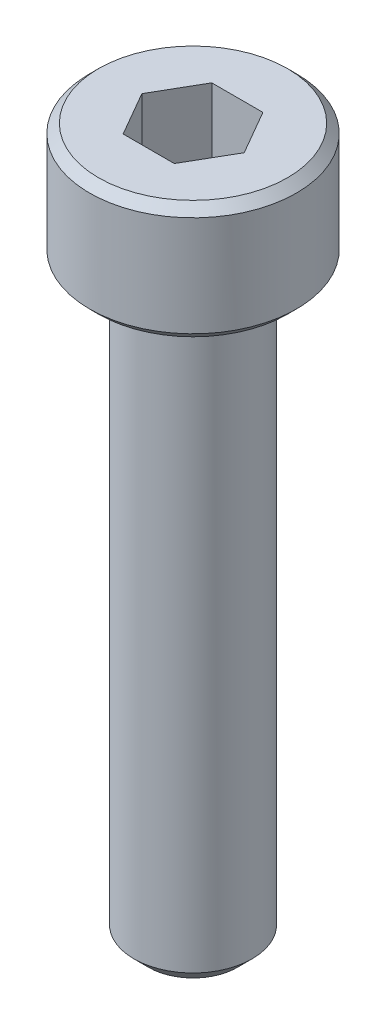
ISO-10303-21;
HEADER;
FILE_DESCRIPTION(('STEP AP214'),'2;1');
FILE_NAME('part.step','',(''),(''),'','','');
FILE_SCHEMA(('AUTOMOTIVE_DESIGN { 1 0 10303 214 1 1 1 1 }'));
ENDSEC;
DATA;
#1=APPLICATION_CONTEXT('core data for automotive mechanical design processes');
#2=APPLICATION_PROTOCOL_DEFINITION('international standard','automotive_design',2000,#1);
#3=PRODUCT_CONTEXT('',#1,'mechanical');
#4=PRODUCT('Part','Part','',(#3));
#5=PRODUCT_RELATED_PRODUCT_CATEGORY('part','',(#4));
#6=PRODUCT_DEFINITION_FORMATION('','',#4);
#7=PRODUCT_DEFINITION_CONTEXT('part definition',#1,'design');
#8=PRODUCT_DEFINITION('design','',#6,#7);
#9=PRODUCT_DEFINITION_SHAPE('','',#8);
#10=(LENGTH_UNIT() NAMED_UNIT(*) SI_UNIT(.MILLI.,.METRE.));
#11=(NAMED_UNIT(*) PLANE_ANGLE_UNIT() SI_UNIT($,.RADIAN.));
#12=(NAMED_UNIT(*) SI_UNIT($,.STERADIAN.) SOLID_ANGLE_UNIT());
#13=UNCERTAINTY_MEASURE_WITH_UNIT(LENGTH_MEASURE(1.E-05),#10,'distance_accuracy_value','');
#14=(GEOMETRIC_REPRESENTATION_CONTEXT(3) GLOBAL_UNCERTAINTY_ASSIGNED_CONTEXT((#13)) GLOBAL_UNIT_ASSIGNED_CONTEXT((#10,
#11,#12)) REPRESENTATION_CONTEXT('',''));
#15=CARTESIAN_POINT('',(0.,0.,0.));
#16=DIRECTION('',(0.,0.,1.));
#17=DIRECTION('',(1.,0.,0.));
#18=AXIS2_PLACEMENT_3D('',#15,#16,#17);
#19=CARTESIAN_POINT('',(0.866025403784439,21.,1.5));
#20=DIRECTION('',(0.866025403784439,0.,0.5));
#21=DIRECTION('',(0.5,0.,-0.866025403784439));
#22=AXIS2_PLACEMENT_3D('',#19,#20,#21);
#23=PLANE('',#22);
#24=DIRECTION('',(0.5,0.,-0.866025403784439));
#25=VECTOR('',#24,1.);
#26=CARTESIAN_POINT('',(0.866025403784439,21.,1.5));
#27=LINE('',#26,#25);
#28=CARTESIAN_POINT('',(0.866025403784439,21.,1.5));
#29=VERTEX_POINT('',#28);
#30=CARTESIAN_POINT('',(1.73205080756888,21.,0.));
#31=VERTEX_POINT('',#30);
#32=EDGE_CURVE('E66',#29,#31,#27,.T.);
#33=ORIENTED_EDGE('',*,*,#32,.F.);
#34=DIRECTION('',(0.,1.,0.));
#35=VECTOR('',#34,1.);
#36=CARTESIAN_POINT('',(0.866025403784439,21.,1.5));
#37=LINE('',#36,#35);
#38=CARTESIAN_POINT('',(0.866025403784439,24.,1.5));
#39=VERTEX_POINT('',#38);
#40=EDGE_CURVE('E85',#29,#39,#37,.T.);
#41=ORIENTED_EDGE('',*,*,#40,.T.);
#42=DIRECTION('',(0.5,0.,-0.866025403784439));
#43=VECTOR('',#42,1.);
#44=CARTESIAN_POINT('',(0.866025403784439,24.,1.5));
#45=LINE('',#44,#43);
#46=CARTESIAN_POINT('',(1.73205080756888,24.,0.));
#47=VERTEX_POINT('',#46);
#48=EDGE_CURVE('E73',#47,#39,#45,.F.);
#49=ORIENTED_EDGE('',*,*,#48,.F.);
#50=DIRECTION('',(0.,1.,0.));
#51=VECTOR('',#50,1.);
#52=CARTESIAN_POINT('',(1.73205080756888,21.,0.));
#53=LINE('',#52,#51);
#54=EDGE_CURVE('E80',#47,#31,#53,.F.);
#55=ORIENTED_EDGE('',*,*,#54,.T.);
#56=EDGE_LOOP('',(#33,#41,#49,#55));
#57=FACE_BOUND('',#56,.T.);
#58=ADVANCED_FACE('F17',(#57),#23,.F.);
#59=CARTESIAN_POINT('',(1.73205080756888,21.,0.));
#60=DIRECTION('',(0.866025403784438,0.,-0.5));
#61=DIRECTION('',(-0.5,0.,-0.866025403784438));
#62=AXIS2_PLACEMENT_3D('',#59,#60,#61);
#63=PLANE('',#62);
#64=DIRECTION('',(-0.5,0.,-0.866025403784438));
#65=VECTOR('',#64,1.);
#66=CARTESIAN_POINT('',(1.73205080756888,21.,0.));
#67=LINE('',#66,#65);
#68=CARTESIAN_POINT('',(0.866025403784438,21.,-1.5));
#69=VERTEX_POINT('',#68);
#70=EDGE_CURVE('E89',#31,#69,#67,.T.);
#71=ORIENTED_EDGE('',*,*,#70,.F.);
#72=ORIENTED_EDGE('',*,*,#54,.F.);
#73=DIRECTION('',(-0.5,0.,-0.866025403784438));
#74=VECTOR('',#73,1.);
#75=CARTESIAN_POINT('',(1.73205080756888,24.,0.));
#76=LINE('',#75,#74);
#77=CARTESIAN_POINT('',(0.866025403784439,24.,-1.5));
#78=VERTEX_POINT('',#77);
#79=EDGE_CURVE('E70',#78,#47,#76,.F.);
#80=ORIENTED_EDGE('',*,*,#79,.F.);
#81=DIRECTION('',(0.,1.,0.));
#82=VECTOR('',#81,1.);
#83=CARTESIAN_POINT('',(0.866025403784438,21.,-1.5));
#84=LINE('',#83,#82);
#85=EDGE_CURVE('E133',#78,#69,#84,.F.);
#86=ORIENTED_EDGE('',*,*,#85,.T.);
#87=EDGE_LOOP('',(#71,#72,#80,#86));
#88=FACE_BOUND('',#87,.T.);
#89=ADVANCED_FACE('F88',(#88),#63,.F.);
#90=CARTESIAN_POINT('',(-0.866025403784438,21.,1.5));
#91=DIRECTION('',(0.,0.,1.));
#92=DIRECTION('',(1.,0.,0.));
#93=AXIS2_PLACEMENT_3D('',#90,#91,#92);
#94=PLANE('',#93);
#95=DIRECTION('',(1.,0.,0.));
#96=VECTOR('',#95,1.);
#97=CARTESIAN_POINT('',(1.73205080756888,21.,1.5));
#98=LINE('',#97,#96);
#99=CARTESIAN_POINT('',(-0.866025403784438,21.,1.5));
#100=VERTEX_POINT('',#99);
#101=EDGE_CURVE('E131',#100,#29,#98,.T.);
#102=ORIENTED_EDGE('',*,*,#101,.F.);
#103=DIRECTION('',(0.,1.,0.));
#104=VECTOR('',#103,1.);
#105=CARTESIAN_POINT('',(-0.866025403784438,21.,1.5));
#106=LINE('',#105,#104);
#107=CARTESIAN_POINT('',(-0.866025403784438,24.,1.5));
#108=VERTEX_POINT('',#107);
#109=EDGE_CURVE('E121',#100,#108,#106,.T.);
#110=ORIENTED_EDGE('',*,*,#109,.T.);
#111=DIRECTION('',(1.,0.,0.));
#112=VECTOR('',#111,1.);
#113=CARTESIAN_POINT('',(-0.866025403784438,24.,1.5));
#114=LINE('',#113,#112);
#115=EDGE_CURVE('E91',#39,#108,#114,.F.);
#116=ORIENTED_EDGE('',*,*,#115,.F.);
#117=ORIENTED_EDGE('',*,*,#40,.F.);
#118=EDGE_LOOP('',(#102,#110,#116,#117));
#119=FACE_BOUND('',#118,.T.);
#120=ADVANCED_FACE('F138',(#119),#94,.F.);
#121=CARTESIAN_POINT('',(0.866025403784438,21.,-1.5));
#122=DIRECTION('',(0.,0.,-1.));
#123=DIRECTION('',(-1.,0.,0.));
#124=AXIS2_PLACEMENT_3D('',#121,#122,#123);
#125=PLANE('',#124);
#126=DIRECTION('',(1.,0.,0.));
#127=VECTOR('',#126,1.);
#128=CARTESIAN_POINT('',(1.73205080756888,21.,-1.5));
#129=LINE('',#128,#127);
#130=CARTESIAN_POINT('',(-0.866025403784438,21.,-1.5));
#131=VERTEX_POINT('',#130);
#132=EDGE_CURVE('E128',#69,#131,#129,.F.);
#133=ORIENTED_EDGE('',*,*,#132,.F.);
#134=ORIENTED_EDGE('',*,*,#85,.F.);
#135=DIRECTION('',(-1.,0.,0.));
#136=VECTOR('',#135,1.);
#137=CARTESIAN_POINT('',(0.866025403784438,24.,-1.5));
#138=LINE('',#137,#136);
#139=CARTESIAN_POINT('',(-0.866025403784438,24.,-1.5));
#140=VERTEX_POINT('',#139);
#141=EDGE_CURVE('E75',#140,#78,#138,.F.);
#142=ORIENTED_EDGE('',*,*,#141,.F.);
#143=DIRECTION('',(0.,1.,0.));
#144=VECTOR('',#143,1.);
#145=CARTESIAN_POINT('',(-0.866025403784438,21.,-1.5));
#146=LINE('',#145,#144);
#147=EDGE_CURVE('E119',#140,#131,#146,.F.);
#148=ORIENTED_EDGE('',*,*,#147,.T.);
#149=EDGE_LOOP('',(#133,#134,#142,#148));
#150=FACE_BOUND('',#149,.T.);
#151=ADVANCED_FACE('F150',(#150),#125,.F.);
#152=CARTESIAN_POINT('',(1.73205080756888,21.,0.));
#153=DIRECTION('',(0.,1.,0.));
#154=DIRECTION('',(0.,0.,1.));
#155=AXIS2_PLACEMENT_3D('',#152,#153,#154);
#156=PLANE('',#155);
#157=ORIENTED_EDGE('',*,*,#132,.T.);
#158=DIRECTION('',(-0.5,0.,0.866025403784439));
#159=VECTOR('',#158,1.);
#160=CARTESIAN_POINT('',(-0.866025403784438,21.,-1.5));
#161=LINE('',#160,#159);
#162=CARTESIAN_POINT('',(-1.73205080756888,21.,0.));
#163=VERTEX_POINT('',#162);
#164=EDGE_CURVE('E117',#131,#163,#161,.T.);
#165=ORIENTED_EDGE('',*,*,#164,.T.);
#166=DIRECTION('',(0.5,0.,0.866025403784439));
#167=VECTOR('',#166,1.);
#168=CARTESIAN_POINT('',(-1.73205080756888,21.,0.));
#169=LINE('',#168,#167);
#170=EDGE_CURVE('E124',#163,#100,#169,.T.);
#171=ORIENTED_EDGE('',*,*,#170,.T.);
#172=ORIENTED_EDGE('',*,*,#101,.T.);
#173=ORIENTED_EDGE('',*,*,#32,.T.);
#174=ORIENTED_EDGE('',*,*,#70,.T.);
#175=EDGE_LOOP('',(#157,#165,#171,#172,#173,#174));
#176=FACE_BOUND('',#175,.T.);
#177=ADVANCED_FACE('F151',(#176),#156,.T.);
#178=CARTESIAN_POINT('',(-1.73205080756888,21.,0.));
#179=DIRECTION('',(-0.866025403784439,0.,0.5));
#180=DIRECTION('',(0.5,0.,0.866025403784439));
#181=AXIS2_PLACEMENT_3D('',#178,#179,#180);
#182=PLANE('',#181);
#183=ORIENTED_EDGE('',*,*,#170,.F.);
#184=DIRECTION('',(0.,1.,0.));
#185=VECTOR('',#184,1.);
#186=CARTESIAN_POINT('',(-1.73205080756888,21.,0.));
#187=LINE('',#186,#185);
#188=CARTESIAN_POINT('',(-1.73205080756888,24.,0.));
#189=VERTEX_POINT('',#188);
#190=EDGE_CURVE('E115',#163,#189,#187,.T.);
#191=ORIENTED_EDGE('',*,*,#190,.T.);
#192=DIRECTION('',(0.5,0.,0.866025403784439));
#193=VECTOR('',#192,1.);
#194=CARTESIAN_POINT('',(-1.73205080756888,24.,0.));
#195=LINE('',#194,#193);
#196=EDGE_CURVE('E35',#108,#189,#195,.F.);
#197=ORIENTED_EDGE('',*,*,#196,.F.);
#198=ORIENTED_EDGE('',*,*,#109,.F.);
#199=EDGE_LOOP('',(#183,#191,#197,#198));
#200=FACE_BOUND('',#199,.T.);
#201=ADVANCED_FACE('F141',(#200),#182,.F.);
#202=CARTESIAN_POINT('',(-0.866025403784438,21.,-1.5));
#203=DIRECTION('',(-0.866025403784439,0.,-0.5));
#204=DIRECTION('',(-0.5,0.,0.866025403784439));
#205=AXIS2_PLACEMENT_3D('',#202,#203,#204);
#206=PLANE('',#205);
#207=ORIENTED_EDGE('',*,*,#164,.F.);
#208=ORIENTED_EDGE('',*,*,#147,.F.);
#209=DIRECTION('',(0.5,0.,-0.866025403784439));
#210=VECTOR('',#209,1.);
#211=CARTESIAN_POINT('',(-1.73205080756888,24.,0.));
#212=LINE('',#211,#210);
#213=EDGE_CURVE('E113',#189,#140,#212,.T.);
#214=ORIENTED_EDGE('',*,*,#213,.F.);
#215=ORIENTED_EDGE('',*,*,#190,.F.);
#216=EDGE_LOOP('',(#207,#208,#214,#215));
#217=FACE_BOUND('',#216,.T.);
#218=ADVANCED_FACE('F147',(#217),#206,.F.);
#219=CARTESIAN_POINT('',(0.,24.,-3.5));
#220=DIRECTION('',(0.,1.,0.));
#221=DIRECTION('',(0.,0.,1.));
#222=AXIS2_PLACEMENT_3D('',#219,#220,#221);
#223=PLANE('',#222);
#224=CARTESIAN_POINT('',(0.,24.0000000000009,0.));
#225=DIRECTION('',(0.,-1.,0.));
#226=DIRECTION('',(1.,0.,0.));
#227=AXIS2_PLACEMENT_3D('',#224,#225,#226);
#228=CIRCLE('',#227,3.19999999999254);
#229=CARTESIAN_POINT('',(3.19999999999254,24.0000000000009,0.));
#230=VERTEX_POINT('',#229);
#231=EDGE_CURVE('E20',#230,#230,#228,.T.);
#232=ORIENTED_EDGE('',*,*,#231,.F.);
#233=EDGE_LOOP('',(#232));
#234=FACE_BOUND('',#233,.T.);
#235=ORIENTED_EDGE('',*,*,#196,.T.);
#236=ORIENTED_EDGE('',*,*,#213,.T.);
#237=ORIENTED_EDGE('',*,*,#141,.T.);
#238=ORIENTED_EDGE('',*,*,#79,.T.);
#239=ORIENTED_EDGE('',*,*,#48,.T.);
#240=ORIENTED_EDGE('',*,*,#115,.T.);
#241=EDGE_LOOP('',(#235,#236,#237,#238,#239,#240));
#242=FACE_BOUND('',#241,.T.);
#243=ADVANCED_FACE('F72',(#234,#242),#223,.T.);
#244=CARTESIAN_POINT('',(0.,23.6999999999057,0.));
#245=DIRECTION('',(0.,-1.,0.));
#246=DIRECTION('',(1.,0.,0.));
#247=AXIS2_PLACEMENT_3D('',#244,#245,#246);
#248=CONICAL_SURFACE('',#247,3.49999999997408,0.78539816320797);
#249=CARTESIAN_POINT('',(0.,23.7,0.));
#250=DIRECTION('',(0.,-1.,0.));
#251=DIRECTION('',(0.,0.,-1.));
#252=AXIS2_PLACEMENT_3D('',#249,#250,#251);
#253=CIRCLE('',#252,3.5);
#254=CARTESIAN_POINT('',(0.,23.7,-3.5));
#255=VERTEX_POINT('',#254);
#256=EDGE_CURVE('E106',#255,#255,#253,.T.);
#257=ORIENTED_EDGE('',*,*,#256,.F.);
#258=EDGE_LOOP('',(#257));
#259=FACE_BOUND('',#258,.T.);
#260=ORIENTED_EDGE('',*,*,#231,.T.);
#261=EDGE_LOOP('',(#260));
#262=FACE_BOUND('',#261,.T.);
#263=ADVANCED_FACE('F186',(#259,#262),#248,.T.);
#264=CARTESIAN_POINT('',(0.,0.,0.));
#265=DIRECTION('',(0.,-1.,0.));
#266=DIRECTION('',(0.,0.,-1.));
#267=AXIS2_PLACEMENT_3D('',#264,#265,#266);
#268=CYLINDRICAL_SURFACE('',#267,3.5);
#269=CARTESIAN_POINT('',(0.,20.3000000000202,0.));
#270=DIRECTION('',(0.,1.,0.));
#271=DIRECTION('',(0.,0.,1.));
#272=AXIS2_PLACEMENT_3D('',#269,#270,#271);
#273=CIRCLE('',#272,3.50000000003092);
#274=CARTESIAN_POINT('',(0.,20.3000000000202,3.50000000003092));
#275=VERTEX_POINT('',#274);
#276=EDGE_CURVE('E102',#275,#275,#273,.F.);
#277=ORIENTED_EDGE('',*,*,#276,.F.);
#278=EDGE_LOOP('',(#277));
#279=FACE_BOUND('',#278,.T.);
#280=ORIENTED_EDGE('',*,*,#256,.T.);
#281=EDGE_LOOP('',(#280));
#282=FACE_BOUND('',#281,.T.);
#283=ADVANCED_FACE('F183',(#279,#282),#268,.T.);
#284=CARTESIAN_POINT('',(0.,20.2999999999065,0.));
#285=DIRECTION('',(0.,1.,0.));
#286=DIRECTION('',(0.,0.,1.));
#287=AXIS2_PLACEMENT_3D('',#284,#285,#286);
#288=CONICAL_SURFACE('',#287,3.49999999991724,0.785398163397448);
#289=ORIENTED_EDGE('',*,*,#276,.T.);
#290=EDGE_LOOP('',(#289));
#291=FACE_BOUND('',#290,.T.);
#292=CARTESIAN_POINT('',(0.,19.999999999925,0.));
#293=DIRECTION('',(0.,1.,0.));
#294=DIRECTION('',(0.,0.,1.));
#295=AXIS2_PLACEMENT_3D('',#292,#293,#294);
#296=CIRCLE('',#295,3.1999999999357);
#297=CARTESIAN_POINT('',(0.,19.999999999925,3.1999999999357));
#298=VERTEX_POINT('',#297);
#299=EDGE_CURVE('E100',#298,#298,#296,.F.);
#300=ORIENTED_EDGE('',*,*,#299,.F.);
#301=EDGE_LOOP('',(#300));
#302=FACE_BOUND('',#301,.T.);
#303=ADVANCED_FACE('F179',(#291,#302),#288,.T.);
#304=CARTESIAN_POINT('',(0.,0.,0.));
#305=DIRECTION('',(0.,-1.,0.));
#306=DIRECTION('',(0.,0.,-1.));
#307=AXIS2_PLACEMENT_3D('',#304,#305,#306);
#308=PLANE('',#307);
#309=CARTESIAN_POINT('',(0.,1.13686837721616E-10,0.));
#310=DIRECTION('',(0.,1.,0.));
#311=DIRECTION('',(0.,0.,1.));
#312=AXIS2_PLACEMENT_3D('',#309,#310,#311);
#313=CIRCLE('',#312,1.50000000002137);
#314=CARTESIAN_POINT('',(0.,1.13686837721616E-10,1.50000000002137));
#315=VERTEX_POINT('',#314);
#316=EDGE_CURVE('E98',#315,#315,#313,.T.);
#317=ORIENTED_EDGE('',*,*,#316,.F.);
#318=EDGE_LOOP('',(#317));
#319=FACE_BOUND('',#318,.T.);
#320=ADVANCED_FACE('F176',(#319),#308,.T.);
#321=CARTESIAN_POINT('',(0.,20.,-2.));
#322=DIRECTION('',(0.,-1.,0.));
#323=DIRECTION('',(0.,0.,-1.));
#324=AXIS2_PLACEMENT_3D('',#321,#322,#323);
#325=PLANE('',#324);
#326=ORIENTED_EDGE('',*,*,#299,.T.);
#327=EDGE_LOOP('',(#326));
#328=FACE_BOUND('',#327,.T.);
#329=CARTESIAN_POINT('',(0.,20.,0.));
#330=DIRECTION('',(0.,-1.,0.));
#331=DIRECTION('',(0.,0.,-1.));
#332=AXIS2_PLACEMENT_3D('',#329,#330,#331);
#333=CIRCLE('',#332,2.);
#334=CARTESIAN_POINT('',(0.,20.,-2.));
#335=VERTEX_POINT('',#334);
#336=EDGE_CURVE('E26',#335,#335,#333,.T.);
#337=ORIENTED_EDGE('',*,*,#336,.F.);
#338=EDGE_LOOP('',(#337));
#339=FACE_BOUND('',#338,.T.);
#340=ADVANCED_FACE('F169',(#328,#339),#325,.T.);
#341=CARTESIAN_POINT('',(0.,0.50000000004502,0.));
#342=DIRECTION('',(0.,1.,0.));
#343=DIRECTION('',(0.,0.,1.));
#344=AXIS2_PLACEMENT_3D('',#341,#342,#343);
#345=CONICAL_SURFACE('',#344,1.99999999995271,0.785398163397448);
#346=CARTESIAN_POINT('',(0.,0.500000000000003,0.));
#347=DIRECTION('',(0.,-1.,0.));
#348=DIRECTION('',(0.,0.,-1.));
#349=AXIS2_PLACEMENT_3D('',#346,#347,#348);
#350=CIRCLE('',#349,2.);
#351=CARTESIAN_POINT('',(0.,0.500000000000003,-2.));
#352=VERTEX_POINT('',#351);
#353=EDGE_CURVE('E11',#352,#352,#350,.F.);
#354=ORIENTED_EDGE('',*,*,#353,.F.);
#355=EDGE_LOOP('',(#354));
#356=FACE_BOUND('',#355,.T.);
#357=ORIENTED_EDGE('',*,*,#316,.T.);
#358=EDGE_LOOP('',(#357));
#359=FACE_BOUND('',#358,.T.);
#360=ADVANCED_FACE('F163',(#356,#359),#345,.T.);
#361=CARTESIAN_POINT('',(0.,0.,0.));
#362=DIRECTION('',(0.,-1.,0.));
#363=DIRECTION('',(0.,0.,-1.));
#364=AXIS2_PLACEMENT_3D('',#361,#362,#363);
#365=CYLINDRICAL_SURFACE('',#364,2.);
#366=ORIENTED_EDGE('',*,*,#353,.T.);
#367=EDGE_LOOP('',(#366));
#368=FACE_BOUND('',#367,.T.);
#369=ORIENTED_EDGE('',*,*,#336,.T.);
#370=EDGE_LOOP('',(#369));
#371=FACE_BOUND('',#370,.T.);
#372=ADVANCED_FACE('F161',(#368,#371),#365,.T.);
#373=CLOSED_SHELL('',(#58,#89,#120,#151,#177,#201,#218,#243,#263,#283,#303,#320,#340,#360,#372));
#374=MANIFOLD_SOLID_BREP('B1',#373);
#375=ADVANCED_BREP_SHAPE_REPRESENTATION('',(#18,#374),#14);
#376=SHAPE_DEFINITION_REPRESENTATION(#9,#375);
ENDSEC;
END-ISO-10303-21;
